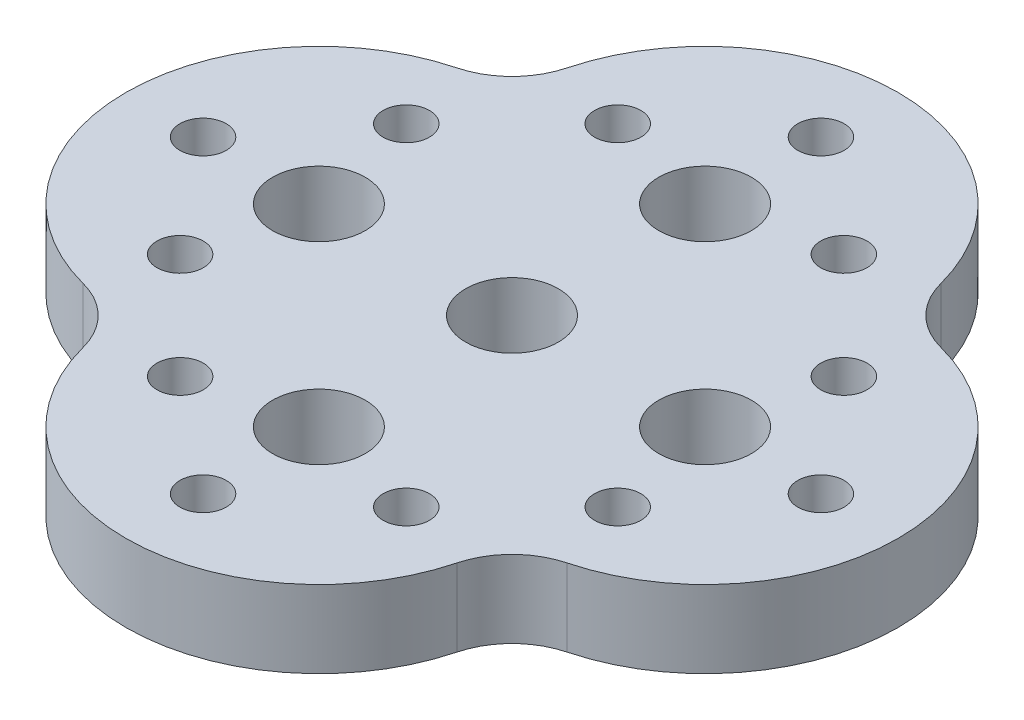
ISO-10303-21;
HEADER;
FILE_DESCRIPTION(('STEP AP214'),'2;1');
FILE_NAME('part.step','',(''),(''),'','','');
FILE_SCHEMA(('AUTOMOTIVE_DESIGN { 1 0 10303 214 1 1 1 1 }'));
ENDSEC;
DATA;
#1=APPLICATION_CONTEXT('core data for automotive mechanical design processes');
#2=APPLICATION_PROTOCOL_DEFINITION('international standard','automotive_design',2000,#1);
#3=PRODUCT_CONTEXT('',#1,'mechanical');
#4=PRODUCT('Part','Part','',(#3));
#5=PRODUCT_RELATED_PRODUCT_CATEGORY('part','',(#4));
#6=PRODUCT_DEFINITION_FORMATION('','',#4);
#7=PRODUCT_DEFINITION_CONTEXT('part definition',#1,'design');
#8=PRODUCT_DEFINITION('design','',#6,#7);
#9=PRODUCT_DEFINITION_SHAPE('','',#8);
#10=(LENGTH_UNIT() NAMED_UNIT(*) SI_UNIT(.MILLI.,.METRE.));
#11=(NAMED_UNIT(*) PLANE_ANGLE_UNIT() SI_UNIT($,.RADIAN.));
#12=(NAMED_UNIT(*) SI_UNIT($,.STERADIAN.) SOLID_ANGLE_UNIT());
#13=UNCERTAINTY_MEASURE_WITH_UNIT(LENGTH_MEASURE(1.E-05),#10,'distance_accuracy_value','');
#14=(GEOMETRIC_REPRESENTATION_CONTEXT(3) GLOBAL_UNCERTAINTY_ASSIGNED_CONTEXT((#13)) GLOBAL_UNIT_ASSIGNED_CONTEXT((#10,
#11,#12)) REPRESENTATION_CONTEXT('',''));
#15=CARTESIAN_POINT('',(0.,0.,0.));
#16=DIRECTION('',(0.,0.,1.));
#17=DIRECTION('',(1.,0.,0.));
#18=AXIS2_PLACEMENT_3D('',#15,#16,#17);
#19=CARTESIAN_POINT('',(860.044237827663,254.,860.044237827663));
#20=DIRECTION('',(0.,-1.,0.));
#21=DIRECTION('',(0.,0.,-1.));
#22=AXIS2_PLACEMENT_3D('',#19,#20,#21);
#23=CYLINDRICAL_SURFACE('',#22,254.);
#24=CARTESIAN_POINT('',(860.044237827663,0.,860.044237827663));
#25=DIRECTION('',(0.,-1.,0.));
#26=DIRECTION('',(0.,0.,-1.));
#27=AXIS2_PLACEMENT_3D('',#24,#25,#26);
#28=CIRCLE('',#27,254.);
#29=CARTESIAN_POINT('',(614.317312734045,0.,795.745884162617));
#30=VERTEX_POINT('',#29);
#31=CARTESIAN_POINT('',(795.745884162616,0.,614.317312734045));
#32=VERTEX_POINT('',#31);
#33=EDGE_CURVE('E199',#30,#32,#28,.T.);
#34=ORIENTED_EDGE('',*,*,#33,.T.);
#35=DIRECTION('',(0.,-1.,0.));
#36=VECTOR('',#35,1.);
#37=CARTESIAN_POINT('',(795.745884162616,254.,614.317312734045));
#38=LINE('',#37,#36);
#39=CARTESIAN_POINT('',(795.745884162616,254.,614.317312734045));
#40=VERTEX_POINT('',#39);
#41=EDGE_CURVE('E13',#40,#32,#38,.T.);
#42=ORIENTED_EDGE('',*,*,#41,.F.);
#43=CARTESIAN_POINT('',(860.044237827663,254.,860.044237827663));
#44=DIRECTION('',(0.,-1.,0.));
#45=DIRECTION('',(0.,0.,-1.));
#46=AXIS2_PLACEMENT_3D('',#43,#44,#45);
#47=CIRCLE('',#46,254.);
#48=CARTESIAN_POINT('',(614.317312734045,254.,795.745884162617));
#49=VERTEX_POINT('',#48);
#50=EDGE_CURVE('E214',#49,#40,#47,.T.);
#51=ORIENTED_EDGE('',*,*,#50,.F.);
#52=DIRECTION('',(0.,-1.,0.));
#53=VECTOR('',#52,1.);
#54=CARTESIAN_POINT('',(614.317312734045,254.,795.745884162617));
#55=LINE('',#54,#53);
#56=EDGE_CURVE('E195',#49,#30,#55,.T.);
#57=ORIENTED_EDGE('',*,*,#56,.T.);
#58=EDGE_LOOP('',(#34,#42,#51,#57));
#59=FACE_BOUND('',#58,.T.);
#60=ADVANCED_FACE('F103',(#59),#23,.F.);
#61=CARTESIAN_POINT('',(635.,254.,0.));
#62=DIRECTION('',(0.,-1.,0.));
#63=DIRECTION('',(0.,0.,-1.));
#64=AXIS2_PLACEMENT_3D('',#61,#62,#63);
#65=CYLINDRICAL_SURFACE('',#64,635.);
#66=CARTESIAN_POINT('',(635.,0.,0.));
#67=DIRECTION('',(0.,1.,0.));
#68=DIRECTION('',(0.,0.,-1.));
#69=AXIS2_PLACEMENT_3D('',#66,#67,#68);
#70=CIRCLE('',#69,635.);
#71=CARTESIAN_POINT('',(795.745884162616,0.,-614.317312734045));
#72=VERTEX_POINT('',#71);
#73=EDGE_CURVE('E202',#32,#72,#70,.T.);
#74=ORIENTED_EDGE('',*,*,#73,.T.);
#75=DIRECTION('',(0.,-1.,0.));
#76=VECTOR('',#75,1.);
#77=CARTESIAN_POINT('',(795.745884162616,254.,-614.317312734045));
#78=LINE('',#77,#76);
#79=CARTESIAN_POINT('',(795.745884162616,254.,-614.317312734045));
#80=VERTEX_POINT('',#79);
#81=EDGE_CURVE('E111',#80,#72,#78,.T.);
#82=ORIENTED_EDGE('',*,*,#81,.F.);
#83=CARTESIAN_POINT('',(635.,254.,0.));
#84=DIRECTION('',(0.,1.,0.));
#85=DIRECTION('',(0.,0.,-1.));
#86=AXIS2_PLACEMENT_3D('',#83,#84,#85);
#87=CIRCLE('',#86,635.);
#88=EDGE_CURVE('E162',#40,#80,#87,.T.);
#89=ORIENTED_EDGE('',*,*,#88,.F.);
#90=ORIENTED_EDGE('',*,*,#41,.T.);
#91=EDGE_LOOP('',(#74,#82,#89,#90));
#92=FACE_BOUND('',#91,.T.);
#93=ADVANCED_FACE('F409',(#92),#65,.T.);
#94=CARTESIAN_POINT('',(860.044237827663,254.,-860.044237827663));
#95=DIRECTION('',(0.,-1.,0.));
#96=DIRECTION('',(0.,0.,-1.));
#97=AXIS2_PLACEMENT_3D('',#94,#95,#96);
#98=CYLINDRICAL_SURFACE('',#97,254.);
#99=CARTESIAN_POINT('',(860.044237827663,0.,-860.044237827663));
#100=DIRECTION('',(0.,-1.,0.));
#101=DIRECTION('',(0.,0.,-1.));
#102=AXIS2_PLACEMENT_3D('',#99,#100,#101);
#103=CIRCLE('',#102,254.);
#104=CARTESIAN_POINT('',(614.317312734045,0.,-795.745884162616));
#105=VERTEX_POINT('',#104);
#106=EDGE_CURVE('E205',#72,#105,#103,.T.);
#107=ORIENTED_EDGE('',*,*,#106,.T.);
#108=DIRECTION('',(0.,-1.,0.));
#109=VECTOR('',#108,1.);
#110=CARTESIAN_POINT('',(614.317312734045,254.,-795.745884162616));
#111=LINE('',#110,#109);
#112=CARTESIAN_POINT('',(614.317312734045,254.,-795.745884162616));
#113=VERTEX_POINT('',#112);
#114=EDGE_CURVE('E221',#113,#105,#111,.T.);
#115=ORIENTED_EDGE('',*,*,#114,.F.);
#116=CARTESIAN_POINT('',(860.044237827663,254.,-860.044237827663));
#117=DIRECTION('',(0.,-1.,0.));
#118=DIRECTION('',(0.,0.,-1.));
#119=AXIS2_PLACEMENT_3D('',#116,#117,#118);
#120=CIRCLE('',#119,254.);
#121=EDGE_CURVE('E229',#80,#113,#120,.T.);
#122=ORIENTED_EDGE('',*,*,#121,.F.);
#123=ORIENTED_EDGE('',*,*,#81,.T.);
#124=EDGE_LOOP('',(#107,#115,#122,#123));
#125=FACE_BOUND('',#124,.T.);
#126=ADVANCED_FACE('F227',(#125),#98,.F.);
#127=CARTESIAN_POINT('',(0.,254.,-635.));
#128=DIRECTION('',(0.,-1.,0.));
#129=DIRECTION('',(0.,0.,-1.));
#130=AXIS2_PLACEMENT_3D('',#127,#128,#129);
#131=CYLINDRICAL_SURFACE('',#130,635.);
#132=CARTESIAN_POINT('',(0.,0.,-635.));
#133=DIRECTION('',(0.,1.,0.));
#134=DIRECTION('',(0.,0.,-1.));
#135=AXIS2_PLACEMENT_3D('',#132,#133,#134);
#136=CIRCLE('',#135,635.);
#137=CARTESIAN_POINT('',(-614.317312734045,0.,-795.745884162616));
#138=VERTEX_POINT('',#137);
#139=EDGE_CURVE('E207',#105,#138,#136,.T.);
#140=ORIENTED_EDGE('',*,*,#139,.T.);
#141=DIRECTION('',(0.,-1.,0.));
#142=VECTOR('',#141,1.);
#143=CARTESIAN_POINT('',(-614.317312734045,254.,-795.745884162616));
#144=LINE('',#143,#142);
#145=CARTESIAN_POINT('',(-614.317312734045,254.,-795.745884162616));
#146=VERTEX_POINT('',#145);
#147=EDGE_CURVE('E218',#146,#138,#144,.T.);
#148=ORIENTED_EDGE('',*,*,#147,.F.);
#149=CARTESIAN_POINT('',(0.,254.,-635.));
#150=DIRECTION('',(0.,1.,0.));
#151=DIRECTION('',(0.,0.,-1.));
#152=AXIS2_PLACEMENT_3D('',#149,#150,#151);
#153=CIRCLE('',#152,635.);
#154=EDGE_CURVE('E241',#113,#146,#153,.T.);
#155=ORIENTED_EDGE('',*,*,#154,.F.);
#156=ORIENTED_EDGE('',*,*,#114,.T.);
#157=EDGE_LOOP('',(#140,#148,#155,#156));
#158=FACE_BOUND('',#157,.T.);
#159=ADVANCED_FACE('F237',(#158),#131,.T.);
#160=CARTESIAN_POINT('',(-860.044237827663,254.,-860.044237827663));
#161=DIRECTION('',(0.,-1.,0.));
#162=DIRECTION('',(0.,0.,-1.));
#163=AXIS2_PLACEMENT_3D('',#160,#161,#162);
#164=CYLINDRICAL_SURFACE('',#163,254.);
#165=CARTESIAN_POINT('',(-860.044237827663,0.,-860.044237827663));
#166=DIRECTION('',(0.,-1.,0.));
#167=DIRECTION('',(0.,0.,-1.));
#168=AXIS2_PLACEMENT_3D('',#165,#166,#167);
#169=CIRCLE('',#168,254.);
#170=CARTESIAN_POINT('',(-795.745884162616,0.,-614.317312734045));
#171=VERTEX_POINT('',#170);
#172=EDGE_CURVE('E209',#138,#171,#169,.T.);
#173=ORIENTED_EDGE('',*,*,#172,.T.);
#174=DIRECTION('',(0.,-1.,0.));
#175=VECTOR('',#174,1.);
#176=CARTESIAN_POINT('',(-795.745884162616,254.,-614.317312734045));
#177=LINE('',#176,#175);
#178=CARTESIAN_POINT('',(-795.745884162616,254.,-614.317312734045));
#179=VERTEX_POINT('',#178);
#180=EDGE_CURVE('E190',#179,#171,#177,.T.);
#181=ORIENTED_EDGE('',*,*,#180,.F.);
#182=CARTESIAN_POINT('',(-860.044237827663,254.,-860.044237827663));
#183=DIRECTION('',(0.,-1.,0.));
#184=DIRECTION('',(0.,0.,-1.));
#185=AXIS2_PLACEMENT_3D('',#182,#183,#184);
#186=CIRCLE('',#185,254.);
#187=EDGE_CURVE('E181',#146,#179,#186,.T.);
#188=ORIENTED_EDGE('',*,*,#187,.F.);
#189=ORIENTED_EDGE('',*,*,#147,.T.);
#190=EDGE_LOOP('',(#173,#181,#188,#189));
#191=FACE_BOUND('',#190,.T.);
#192=ADVANCED_FACE('F240',(#191),#164,.F.);
#193=CARTESIAN_POINT('',(-635.,254.,0.));
#194=DIRECTION('',(0.,-1.,0.));
#195=DIRECTION('',(0.,0.,-1.));
#196=AXIS2_PLACEMENT_3D('',#193,#194,#195);
#197=CYLINDRICAL_SURFACE('',#196,635.);
#198=CARTESIAN_POINT('',(-635.,0.,0.));
#199=DIRECTION('',(0.,1.,0.));
#200=DIRECTION('',(0.,0.,1.));
#201=AXIS2_PLACEMENT_3D('',#198,#199,#200);
#202=CIRCLE('',#201,635.);
#203=CARTESIAN_POINT('',(-795.745884162616,0.,614.317312734045));
#204=VERTEX_POINT('',#203);
#205=EDGE_CURVE('E189',#171,#204,#202,.T.);
#206=ORIENTED_EDGE('',*,*,#205,.T.);
#207=DIRECTION('',(0.,-1.,0.));
#208=VECTOR('',#207,1.);
#209=CARTESIAN_POINT('',(-795.745884162616,254.,614.317312734045));
#210=LINE('',#209,#208);
#211=CARTESIAN_POINT('',(-795.745884162616,254.,614.317312734045));
#212=VERTEX_POINT('',#211);
#213=EDGE_CURVE('E186',#212,#204,#210,.T.);
#214=ORIENTED_EDGE('',*,*,#213,.F.);
#215=CARTESIAN_POINT('',(-635.,254.,0.));
#216=DIRECTION('',(0.,1.,0.));
#217=DIRECTION('',(0.,0.,1.));
#218=AXIS2_PLACEMENT_3D('',#215,#216,#217);
#219=CIRCLE('',#218,635.);
#220=EDGE_CURVE('E175',#179,#212,#219,.T.);
#221=ORIENTED_EDGE('',*,*,#220,.F.);
#222=ORIENTED_EDGE('',*,*,#180,.T.);
#223=EDGE_LOOP('',(#206,#214,#221,#222));
#224=FACE_BOUND('',#223,.T.);
#225=ADVANCED_FACE('F187',(#224),#197,.T.);
#226=CARTESIAN_POINT('',(-860.044237827663,254.,860.044237827663));
#227=DIRECTION('',(0.,-1.,0.));
#228=DIRECTION('',(0.,0.,-1.));
#229=AXIS2_PLACEMENT_3D('',#226,#227,#228);
#230=CYLINDRICAL_SURFACE('',#229,254.);
#231=CARTESIAN_POINT('',(-860.044237827663,0.,860.044237827663));
#232=DIRECTION('',(0.,-1.,0.));
#233=DIRECTION('',(0.,0.,-1.));
#234=AXIS2_PLACEMENT_3D('',#231,#232,#233);
#235=CIRCLE('',#234,254.);
#236=CARTESIAN_POINT('',(-614.317312734045,0.,795.745884162617));
#237=VERTEX_POINT('',#236);
#238=EDGE_CURVE('E148',#204,#237,#235,.T.);
#239=ORIENTED_EDGE('',*,*,#238,.T.);
#240=DIRECTION('',(0.,-1.,0.));
#241=VECTOR('',#240,1.);
#242=CARTESIAN_POINT('',(-614.317312734045,254.,795.745884162617));
#243=LINE('',#242,#241);
#244=CARTESIAN_POINT('',(-614.317312734045,254.,795.745884162617));
#245=VERTEX_POINT('',#244);
#246=EDGE_CURVE('E191',#245,#237,#243,.T.);
#247=ORIENTED_EDGE('',*,*,#246,.F.);
#248=CARTESIAN_POINT('',(-860.044237827663,254.,860.044237827663));
#249=DIRECTION('',(0.,-1.,0.));
#250=DIRECTION('',(0.,0.,-1.));
#251=AXIS2_PLACEMENT_3D('',#248,#249,#250);
#252=CIRCLE('',#251,254.);
#253=EDGE_CURVE('E179',#212,#245,#252,.T.);
#254=ORIENTED_EDGE('',*,*,#253,.F.);
#255=ORIENTED_EDGE('',*,*,#213,.T.);
#256=EDGE_LOOP('',(#239,#247,#254,#255));
#257=FACE_BOUND('',#256,.T.);
#258=ADVANCED_FACE('F193',(#257),#230,.F.);
#259=CARTESIAN_POINT('',(0.,254.,635.));
#260=DIRECTION('',(0.,-1.,0.));
#261=DIRECTION('',(0.,0.,-1.));
#262=AXIS2_PLACEMENT_3D('',#259,#260,#261);
#263=CYLINDRICAL_SURFACE('',#262,635.);
#264=CARTESIAN_POINT('',(0.,0.,635.));
#265=DIRECTION('',(0.,1.,0.));
#266=DIRECTION('',(0.,0.,-1.));
#267=AXIS2_PLACEMENT_3D('',#264,#265,#266);
#268=CIRCLE('',#267,635.);
#269=EDGE_CURVE('E154',#237,#30,#268,.T.);
#270=ORIENTED_EDGE('',*,*,#269,.T.);
#271=ORIENTED_EDGE('',*,*,#56,.F.);
#272=CARTESIAN_POINT('',(0.,254.,635.));
#273=DIRECTION('',(0.,1.,0.));
#274=DIRECTION('',(0.,0.,-1.));
#275=AXIS2_PLACEMENT_3D('',#272,#273,#274);
#276=CIRCLE('',#275,635.);
#277=EDGE_CURVE('E119',#245,#49,#276,.T.);
#278=ORIENTED_EDGE('',*,*,#277,.F.);
#279=ORIENTED_EDGE('',*,*,#246,.T.);
#280=EDGE_LOOP('',(#270,#271,#278,#279));
#281=FACE_BOUND('',#280,.T.);
#282=ADVANCED_FACE('F360',(#281),#263,.T.);
#283=CARTESIAN_POINT('',(747.522118913832,254.,430.022118913832));
#284=DIRECTION('',(0.,-1.,0.));
#285=DIRECTION('',(0.,0.,-1.));
#286=AXIS2_PLACEMENT_3D('',#283,#284,#285);
#287=PLANE('',#286);
#288=CARTESIAN_POINT('',(0.,254.,0.));
#289=DIRECTION('',(0.,1.,0.));
#290=DIRECTION('',(0.,0.,1.));
#291=AXIS2_PLACEMENT_3D('',#288,#289,#290);
#292=CIRCLE('',#291,152.4);
#293=CARTESIAN_POINT('',(0.,254.,152.4));
#294=VERTEX_POINT('',#293);
#295=EDGE_CURVE('E343',#294,#294,#292,.T.);
#296=ORIENTED_EDGE('',*,*,#295,.F.);
#297=EDGE_LOOP('',(#296));
#298=FACE_BOUND('',#297,.T.);
#299=CARTESIAN_POINT('',(-635.,254.000000000034,-1.11022302462516E-13));
#300=DIRECTION('',(0.,1.,0.));
#301=DIRECTION('',(0.,0.,1.));
#302=AXIS2_PLACEMENT_3D('',#299,#300,#301);
#303=CIRCLE('',#302,152.4);
#304=CARTESIAN_POINT('',(-635.,254.000000000034,152.4));
#305=VERTEX_POINT('',#304);
#306=EDGE_CURVE('E338',#305,#305,#303,.T.);
#307=ORIENTED_EDGE('',*,*,#306,.F.);
#308=EDGE_LOOP('',(#307));
#309=FACE_BOUND('',#308,.T.);
#310=CARTESIAN_POINT('',(0.,254.000000000034,635.));
#311=DIRECTION('',(0.,1.,0.));
#312=DIRECTION('',(0.,0.,1.));
#313=AXIS2_PLACEMENT_3D('',#310,#311,#312);
#314=CIRCLE('',#313,152.4);
#315=CARTESIAN_POINT('',(0.,254.000000000034,787.4));
#316=VERTEX_POINT('',#315);
#317=EDGE_CURVE('E332',#316,#316,#314,.T.);
#318=ORIENTED_EDGE('',*,*,#317,.F.);
#319=EDGE_LOOP('',(#318));
#320=FACE_BOUND('',#319,.T.);
#321=CARTESIAN_POINT('',(635.,254.000000000034,0.));
#322=DIRECTION('',(0.,1.,0.));
#323=DIRECTION('',(0.,0.,1.));
#324=AXIS2_PLACEMENT_3D('',#321,#322,#323);
#325=CIRCLE('',#324,152.4);
#326=CARTESIAN_POINT('',(635.,254.000000000034,152.4));
#327=VERTEX_POINT('',#326);
#328=EDGE_CURVE('E325',#327,#327,#325,.T.);
#329=ORIENTED_EDGE('',*,*,#328,.F.);
#330=EDGE_LOOP('',(#329));
#331=FACE_BOUND('',#330,.T.);
#332=CARTESIAN_POINT('',(0.,254.,-635.));
#333=DIRECTION('',(0.,1.,0.));
#334=DIRECTION('',(0.,0.,1.));
#335=AXIS2_PLACEMENT_3D('',#332,#333,#334);
#336=CIRCLE('',#335,152.4);
#337=CARTESIAN_POINT('',(0.,254.,-482.6));
#338=VERTEX_POINT('',#337);
#339=EDGE_CURVE('E319',#338,#338,#336,.T.);
#340=ORIENTED_EDGE('',*,*,#339,.F.);
#341=EDGE_LOOP('',(#340));
#342=FACE_BOUND('',#341,.T.);
#343=CARTESIAN_POINT('',(371.854888006537,254.000000000003,-719.562357425863));
#344=DIRECTION('',(0.,1.,0.));
#345=DIRECTION('',(0.,0.,1.));
#346=AXIS2_PLACEMENT_3D('',#343,#344,#345);
#347=CIRCLE('',#346,76.2);
#348=CARTESIAN_POINT('',(371.854888006537,254.000000000003,-643.362357425863));
#349=VERTEX_POINT('',#348);
#350=EDGE_CURVE('E302',#349,#349,#347,.T.);
#351=ORIENTED_EDGE('',*,*,#350,.F.);
#352=EDGE_LOOP('',(#351));
#353=FACE_BOUND('',#352,.T.);
#354=CARTESIAN_POINT('',(4.44089209850063E-13,254.000000000003,-1016.));
#355=DIRECTION('',(0.,1.,0.));
#356=DIRECTION('',(0.,0.,1.));
#357=AXIS2_PLACEMENT_3D('',#354,#355,#356);
#358=CIRCLE('',#357,76.2);
#359=CARTESIAN_POINT('',(4.44089209850063E-13,254.000000000003,-939.8));
#360=VERTEX_POINT('',#359);
#361=EDGE_CURVE('E296',#360,#360,#358,.T.);
#362=ORIENTED_EDGE('',*,*,#361,.F.);
#363=EDGE_LOOP('',(#362));
#364=FACE_BOUND('',#363,.T.);
#365=CARTESIAN_POINT('',(-371.854888006536,254.000000000003,-719.562357425864));
#366=DIRECTION('',(0.,1.,0.));
#367=DIRECTION('',(0.,0.,1.));
#368=AXIS2_PLACEMENT_3D('',#365,#366,#367);
#369=CIRCLE('',#368,76.2);
#370=CARTESIAN_POINT('',(-371.854888006536,254.000000000003,-643.362357425864));
#371=VERTEX_POINT('',#370);
#372=EDGE_CURVE('E290',#371,#371,#369,.T.);
#373=ORIENTED_EDGE('',*,*,#372,.F.);
#374=EDGE_LOOP('',(#373));
#375=FACE_BOUND('',#374,.T.);
#376=CARTESIAN_POINT('',(-719.562357425862,254.000000000003,-371.854888006537));
#377=DIRECTION('',(0.,1.,0.));
#378=DIRECTION('',(0.,0.,1.));
#379=AXIS2_PLACEMENT_3D('',#376,#377,#378);
#380=CIRCLE('',#379,76.2);
#381=CARTESIAN_POINT('',(-719.562357425862,254.000000000003,-295.654888006537));
#382=VERTEX_POINT('',#381);
#383=EDGE_CURVE('E284',#382,#382,#380,.T.);
#384=ORIENTED_EDGE('',*,*,#383,.F.);
#385=EDGE_LOOP('',(#384));
#386=FACE_BOUND('',#385,.T.);
#387=CARTESIAN_POINT('',(-1016.,254.000000000003,-4.14942696148656E-13));
#388=DIRECTION('',(0.,1.,0.));
#389=DIRECTION('',(0.,0.,1.));
#390=AXIS2_PLACEMENT_3D('',#387,#388,#389);
#391=CIRCLE('',#390,76.2);
#392=CARTESIAN_POINT('',(-1016.,254.000000000003,76.1999999999995));
#393=VERTEX_POINT('',#392);
#394=EDGE_CURVE('E278',#393,#393,#391,.T.);
#395=ORIENTED_EDGE('',*,*,#394,.F.);
#396=EDGE_LOOP('',(#395));
#397=FACE_BOUND('',#396,.T.);
#398=CARTESIAN_POINT('',(-719.562357425863,254.000000000003,371.854888006536));
#399=DIRECTION('',(0.,1.,0.));
#400=DIRECTION('',(0.,0.,1.));
#401=AXIS2_PLACEMENT_3D('',#398,#399,#400);
#402=CIRCLE('',#401,76.2);
#403=CARTESIAN_POINT('',(-719.562357425863,254.000000000003,448.054888006536));
#404=VERTEX_POINT('',#403);
#405=EDGE_CURVE('E272',#404,#404,#402,.T.);
#406=ORIENTED_EDGE('',*,*,#405,.F.);
#407=EDGE_LOOP('',(#406));
#408=FACE_BOUND('',#407,.T.);
#409=CARTESIAN_POINT('',(-371.854888006537,254.000000000003,719.562357425863));
#410=DIRECTION('',(0.,1.,0.));
#411=DIRECTION('',(0.,0.,1.));
#412=AXIS2_PLACEMENT_3D('',#409,#410,#411);
#413=CIRCLE('',#412,76.2);
#414=CARTESIAN_POINT('',(-371.854888006537,254.000000000003,795.762357425863));
#415=VERTEX_POINT('',#414);
#416=EDGE_CURVE('E266',#415,#415,#413,.T.);
#417=ORIENTED_EDGE('',*,*,#416,.F.);
#418=EDGE_LOOP('',(#417));
#419=FACE_BOUND('',#418,.T.);
#420=CARTESIAN_POINT('',(0.,254.000000000003,1016.));
#421=DIRECTION('',(0.,1.,0.));
#422=DIRECTION('',(0.,0.,1.));
#423=AXIS2_PLACEMENT_3D('',#420,#421,#422);
#424=CIRCLE('',#423,76.2);
#425=CARTESIAN_POINT('',(0.,254.000000000003,1092.2));
#426=VERTEX_POINT('',#425);
#427=EDGE_CURVE('E259',#426,#426,#424,.T.);
#428=ORIENTED_EDGE('',*,*,#427,.F.);
#429=EDGE_LOOP('',(#428));
#430=FACE_BOUND('',#429,.T.);
#431=CARTESIAN_POINT('',(371.854888006536,254.000000000003,719.562357425864));
#432=DIRECTION('',(0.,1.,0.));
#433=DIRECTION('',(0.,0.,1.));
#434=AXIS2_PLACEMENT_3D('',#431,#432,#433);
#435=CIRCLE('',#434,76.2);
#436=CARTESIAN_POINT('',(371.854888006536,254.000000000003,795.762357425864));
#437=VERTEX_POINT('',#436);
#438=EDGE_CURVE('E314',#437,#437,#435,.T.);
#439=ORIENTED_EDGE('',*,*,#438,.F.);
#440=EDGE_LOOP('',(#439));
#441=FACE_BOUND('',#440,.T.);
#442=CARTESIAN_POINT('',(719.562357425862,254.000000000003,371.854888006537));
#443=DIRECTION('',(0.,1.,0.));
#444=DIRECTION('',(0.,0.,1.));
#445=AXIS2_PLACEMENT_3D('',#442,#443,#444);
#446=CIRCLE('',#445,76.2);
#447=CARTESIAN_POINT('',(719.562357425862,254.000000000003,448.054888006537));
#448=VERTEX_POINT('',#447);
#449=EDGE_CURVE('E307',#448,#448,#446,.T.);
#450=ORIENTED_EDGE('',*,*,#449,.F.);
#451=EDGE_LOOP('',(#450));
#452=FACE_BOUND('',#451,.T.);
#453=CARTESIAN_POINT('',(719.562357425863,254.000000000003,-371.854888006536));
#454=DIRECTION('',(0.,1.,0.));
#455=DIRECTION('',(0.,0.,1.));
#456=AXIS2_PLACEMENT_3D('',#453,#454,#455);
#457=CIRCLE('',#456,76.2);
#458=CARTESIAN_POINT('',(719.562357425863,254.000000000003,-295.654888006537));
#459=VERTEX_POINT('',#458);
#460=EDGE_CURVE('E253',#459,#459,#457,.T.);
#461=ORIENTED_EDGE('',*,*,#460,.F.);
#462=EDGE_LOOP('',(#461));
#463=FACE_BOUND('',#462,.T.);
#464=CARTESIAN_POINT('',(1016.,254.,3.38395977905748E-13));
#465=DIRECTION('',(0.,1.,0.));
#466=DIRECTION('',(0.,0.,1.));
#467=AXIS2_PLACEMENT_3D('',#464,#465,#466);
#468=CIRCLE('',#467,76.2);
#469=CARTESIAN_POINT('',(1016.,254.,76.2000000000003));
#470=VERTEX_POINT('',#469);
#471=EDGE_CURVE('E247',#470,#470,#468,.T.);
#472=ORIENTED_EDGE('',*,*,#471,.F.);
#473=EDGE_LOOP('',(#472));
#474=FACE_BOUND('',#473,.T.);
#475=ORIENTED_EDGE('',*,*,#50,.T.);
#476=ORIENTED_EDGE('',*,*,#88,.T.);
#477=ORIENTED_EDGE('',*,*,#121,.T.);
#478=ORIENTED_EDGE('',*,*,#154,.T.);
#479=ORIENTED_EDGE('',*,*,#187,.T.);
#480=ORIENTED_EDGE('',*,*,#220,.T.);
#481=ORIENTED_EDGE('',*,*,#253,.T.);
#482=ORIENTED_EDGE('',*,*,#277,.T.);
#483=EDGE_LOOP('',(#475,#476,#477,#478,#479,#480,#481,#482));
#484=FACE_BOUND('',#483,.T.);
#485=ADVANCED_FACE('F177',(#298,#309,#320,#331,#342,#353,#364,#375,#386,#397,#408,#419,#430,
#441,#452,#463,#474,#484),#287,.F.);
#486=CARTESIAN_POINT('',(747.522118913832,0.,430.022118913832));
#487=DIRECTION('',(0.,-1.,0.));
#488=DIRECTION('',(0.,0.,-1.));
#489=AXIS2_PLACEMENT_3D('',#486,#487,#488);
#490=PLANE('',#489);
#491=CARTESIAN_POINT('',(0.,0.,0.));
#492=DIRECTION('',(0.,1.,0.));
#493=DIRECTION('',(0.,0.,1.));
#494=AXIS2_PLACEMENT_3D('',#491,#492,#493);
#495=CIRCLE('',#494,152.4);
#496=CARTESIAN_POINT('',(0.,0.,152.4));
#497=VERTEX_POINT('',#496);
#498=EDGE_CURVE('E329',#497,#497,#495,.T.);
#499=ORIENTED_EDGE('',*,*,#498,.T.);
#500=EDGE_LOOP('',(#499));
#501=FACE_BOUND('',#500,.T.);
#502=CARTESIAN_POINT('',(-635.,3.3806291099836E-11,-1.11022302462516E-13));
#503=DIRECTION('',(0.,1.,0.));
#504=DIRECTION('',(0.,0.,1.));
#505=AXIS2_PLACEMENT_3D('',#502,#503,#504);
#506=CIRCLE('',#505,152.4);
#507=CARTESIAN_POINT('',(-635.,3.3806291099836E-11,152.4));
#508=VERTEX_POINT('',#507);
#509=EDGE_CURVE('E322',#508,#508,#506,.T.);
#510=ORIENTED_EDGE('',*,*,#509,.T.);
#511=EDGE_LOOP('',(#510));
#512=FACE_BOUND('',#511,.T.);
#513=CARTESIAN_POINT('',(0.,3.3806291099836E-11,635.));
#514=DIRECTION('',(0.,1.,0.));
#515=DIRECTION('',(0.,0.,1.));
#516=AXIS2_PLACEMENT_3D('',#513,#514,#515);
#517=CIRCLE('',#516,152.4);
#518=CARTESIAN_POINT('',(0.,3.3806291099836E-11,787.4));
#519=VERTEX_POINT('',#518);
#520=EDGE_CURVE('E335',#519,#519,#517,.T.);
#521=ORIENTED_EDGE('',*,*,#520,.T.);
#522=EDGE_LOOP('',(#521));
#523=FACE_BOUND('',#522,.T.);
#524=CARTESIAN_POINT('',(635.,3.3806291099836E-11,0.));
#525=DIRECTION('',(0.,1.,0.));
#526=DIRECTION('',(0.,0.,1.));
#527=AXIS2_PLACEMENT_3D('',#524,#525,#526);
#528=CIRCLE('',#527,152.4);
#529=CARTESIAN_POINT('',(635.,3.3806291099836E-11,152.4));
#530=VERTEX_POINT('',#529);
#531=EDGE_CURVE('E328',#530,#530,#528,.T.);
#532=ORIENTED_EDGE('',*,*,#531,.T.);
#533=EDGE_LOOP('',(#532));
#534=FACE_BOUND('',#533,.T.);
#535=CARTESIAN_POINT('',(0.,0.,-635.));
#536=DIRECTION('',(0.,1.,0.));
#537=DIRECTION('',(0.,0.,1.));
#538=AXIS2_PLACEMENT_3D('',#535,#536,#537);
#539=CIRCLE('',#538,152.4);
#540=CARTESIAN_POINT('',(0.,0.,-482.6));
#541=VERTEX_POINT('',#540);
#542=EDGE_CURVE('E311',#541,#541,#539,.T.);
#543=ORIENTED_EDGE('',*,*,#542,.T.);
#544=EDGE_LOOP('',(#543));
#545=FACE_BOUND('',#544,.T.);
#546=CARTESIAN_POINT('',(371.854888006537,2.4980018054066E-12,-719.562357425863));
#547=DIRECTION('',(0.,1.,0.));
#548=DIRECTION('',(0.,0.,1.));
#549=AXIS2_PLACEMENT_3D('',#546,#547,#548);
#550=CIRCLE('',#549,76.2);
#551=CARTESIAN_POINT('',(371.854888006537,2.4980018054066E-12,-643.362357425863));
#552=VERTEX_POINT('',#551);
#553=EDGE_CURVE('E256',#552,#552,#550,.T.);
#554=ORIENTED_EDGE('',*,*,#553,.T.);
#555=EDGE_LOOP('',(#554));
#556=FACE_BOUND('',#555,.T.);
#557=CARTESIAN_POINT('',(4.44089209850063E-13,2.4980018054066E-12,-1016.));
#558=DIRECTION('',(0.,1.,0.));
#559=DIRECTION('',(0.,0.,1.));
#560=AXIS2_PLACEMENT_3D('',#557,#558,#559);
#561=CIRCLE('',#560,76.2);
#562=CARTESIAN_POINT('',(4.44089209850063E-13,2.4980018054066E-12,-939.8));
#563=VERTEX_POINT('',#562);
#564=EDGE_CURVE('E299',#563,#563,#561,.T.);
#565=ORIENTED_EDGE('',*,*,#564,.T.);
#566=EDGE_LOOP('',(#565));
#567=FACE_BOUND('',#566,.T.);
#568=CARTESIAN_POINT('',(-371.854888006536,2.4980018054066E-12,-719.562357425864));
#569=DIRECTION('',(0.,1.,0.));
#570=DIRECTION('',(0.,0.,1.));
#571=AXIS2_PLACEMENT_3D('',#568,#569,#570);
#572=CIRCLE('',#571,76.2);
#573=CARTESIAN_POINT('',(-371.854888006536,2.4980018054066E-12,-643.362357425864));
#574=VERTEX_POINT('',#573);
#575=EDGE_CURVE('E293',#574,#574,#572,.T.);
#576=ORIENTED_EDGE('',*,*,#575,.T.);
#577=EDGE_LOOP('',(#576));
#578=FACE_BOUND('',#577,.T.);
#579=CARTESIAN_POINT('',(-719.562357425862,2.4980018054066E-12,-371.854888006537));
#580=DIRECTION('',(0.,1.,0.));
#581=DIRECTION('',(0.,0.,1.));
#582=AXIS2_PLACEMENT_3D('',#579,#580,#581);
#583=CIRCLE('',#582,76.2);
#584=CARTESIAN_POINT('',(-719.562357425862,2.4980018054066E-12,-295.654888006537));
#585=VERTEX_POINT('',#584);
#586=EDGE_CURVE('E287',#585,#585,#583,.T.);
#587=ORIENTED_EDGE('',*,*,#586,.T.);
#588=EDGE_LOOP('',(#587));
#589=FACE_BOUND('',#588,.T.);
#590=CARTESIAN_POINT('',(-1016.,2.4980018054066E-12,-4.14942696148656E-13));
#591=DIRECTION('',(0.,1.,0.));
#592=DIRECTION('',(0.,0.,1.));
#593=AXIS2_PLACEMENT_3D('',#590,#591,#592);
#594=CIRCLE('',#593,76.2);
#595=CARTESIAN_POINT('',(-1016.,2.4980018054066E-12,76.1999999999995));
#596=VERTEX_POINT('',#595);
#597=EDGE_CURVE('E281',#596,#596,#594,.T.);
#598=ORIENTED_EDGE('',*,*,#597,.T.);
#599=EDGE_LOOP('',(#598));
#600=FACE_BOUND('',#599,.T.);
#601=CARTESIAN_POINT('',(-719.562357425863,2.4980018054066E-12,371.854888006536));
#602=DIRECTION('',(0.,1.,0.));
#603=DIRECTION('',(0.,0.,1.));
#604=AXIS2_PLACEMENT_3D('',#601,#602,#603);
#605=CIRCLE('',#604,76.2);
#606=CARTESIAN_POINT('',(-719.562357425863,2.4980018054066E-12,448.054888006536));
#607=VERTEX_POINT('',#606);
#608=EDGE_CURVE('E275',#607,#607,#605,.T.);
#609=ORIENTED_EDGE('',*,*,#608,.T.);
#610=EDGE_LOOP('',(#609));
#611=FACE_BOUND('',#610,.T.);
#612=CARTESIAN_POINT('',(-371.854888006537,2.4980018054066E-12,719.562357425863));
#613=DIRECTION('',(0.,1.,0.));
#614=DIRECTION('',(0.,0.,1.));
#615=AXIS2_PLACEMENT_3D('',#612,#613,#614);
#616=CIRCLE('',#615,76.2);
#617=CARTESIAN_POINT('',(-371.854888006537,2.4980018054066E-12,795.762357425863));
#618=VERTEX_POINT('',#617);
#619=EDGE_CURVE('E269',#618,#618,#616,.T.);
#620=ORIENTED_EDGE('',*,*,#619,.T.);
#621=EDGE_LOOP('',(#620));
#622=FACE_BOUND('',#621,.T.);
#623=CARTESIAN_POINT('',(0.,2.4980018054066E-12,1016.));
#624=DIRECTION('',(0.,1.,0.));
#625=DIRECTION('',(0.,0.,1.));
#626=AXIS2_PLACEMENT_3D('',#623,#624,#625);
#627=CIRCLE('',#626,76.2);
#628=CARTESIAN_POINT('',(0.,2.4980018054066E-12,1092.2));
#629=VERTEX_POINT('',#628);
#630=EDGE_CURVE('E262',#629,#629,#627,.T.);
#631=ORIENTED_EDGE('',*,*,#630,.T.);
#632=EDGE_LOOP('',(#631));
#633=FACE_BOUND('',#632,.T.);
#634=CARTESIAN_POINT('',(371.854888006536,2.4980018054066E-12,719.562357425864));
#635=DIRECTION('',(0.,1.,0.));
#636=DIRECTION('',(0.,0.,1.));
#637=AXIS2_PLACEMENT_3D('',#634,#635,#636);
#638=CIRCLE('',#637,76.2);
#639=CARTESIAN_POINT('',(371.854888006536,2.4980018054066E-12,795.762357425864));
#640=VERTEX_POINT('',#639);
#641=EDGE_CURVE('E263',#640,#640,#638,.T.);
#642=ORIENTED_EDGE('',*,*,#641,.T.);
#643=EDGE_LOOP('',(#642));
#644=FACE_BOUND('',#643,.T.);
#645=CARTESIAN_POINT('',(719.562357425862,2.4980018054066E-12,371.854888006537));
#646=DIRECTION('',(0.,1.,0.));
#647=DIRECTION('',(0.,0.,1.));
#648=AXIS2_PLACEMENT_3D('',#645,#646,#647);
#649=CIRCLE('',#648,76.2);
#650=CARTESIAN_POINT('',(719.562357425862,2.4980018054066E-12,448.054888006537));
#651=VERTEX_POINT('',#650);
#652=EDGE_CURVE('E310',#651,#651,#649,.T.);
#653=ORIENTED_EDGE('',*,*,#652,.T.);
#654=EDGE_LOOP('',(#653));
#655=FACE_BOUND('',#654,.T.);
#656=CARTESIAN_POINT('',(719.562357425863,2.4980018054066E-12,-371.854888006536));
#657=DIRECTION('',(0.,1.,0.));
#658=DIRECTION('',(0.,0.,1.));
#659=AXIS2_PLACEMENT_3D('',#656,#657,#658);
#660=CIRCLE('',#659,76.2);
#661=CARTESIAN_POINT('',(719.562357425863,2.4980018054066E-12,-295.654888006537));
#662=VERTEX_POINT('',#661);
#663=EDGE_CURVE('E250',#662,#662,#660,.T.);
#664=ORIENTED_EDGE('',*,*,#663,.T.);
#665=EDGE_LOOP('',(#664));
#666=FACE_BOUND('',#665,.T.);
#667=CARTESIAN_POINT('',(1016.,0.,3.38395977905748E-13));
#668=DIRECTION('',(0.,1.,0.));
#669=DIRECTION('',(0.,0.,1.));
#670=AXIS2_PLACEMENT_3D('',#667,#668,#669);
#671=CIRCLE('',#670,76.2);
#672=CARTESIAN_POINT('',(1016.,0.,76.2000000000003));
#673=VERTEX_POINT('',#672);
#674=EDGE_CURVE('E203',#673,#673,#671,.T.);
#675=ORIENTED_EDGE('',*,*,#674,.T.);
#676=EDGE_LOOP('',(#675));
#677=FACE_BOUND('',#676,.T.);
#678=ORIENTED_EDGE('',*,*,#33,.F.);
#679=ORIENTED_EDGE('',*,*,#269,.F.);
#680=ORIENTED_EDGE('',*,*,#238,.F.);
#681=ORIENTED_EDGE('',*,*,#205,.F.);
#682=ORIENTED_EDGE('',*,*,#172,.F.);
#683=ORIENTED_EDGE('',*,*,#139,.F.);
#684=ORIENTED_EDGE('',*,*,#106,.F.);
#685=ORIENTED_EDGE('',*,*,#73,.F.);
#686=EDGE_LOOP('',(#678,#679,#680,#681,#682,#683,#684,#685));
#687=FACE_BOUND('',#686,.T.);
#688=ADVANCED_FACE('F233',(#501,#512,#523,#534,#545,#556,#567,#578,#589,#600,#611,#622,#633,
#644,#655,#666,#677,#687),#490,.T.);
#689=CARTESIAN_POINT('',(1016.,0.,3.38395977905748E-13));
#690=DIRECTION('',(0.,1.,0.));
#691=DIRECTION('',(0.,0.,1.));
#692=AXIS2_PLACEMENT_3D('',#689,#690,#691);
#693=CYLINDRICAL_SURFACE('',#692,76.2);
#694=ORIENTED_EDGE('',*,*,#674,.F.);
#695=EDGE_LOOP('',(#694));
#696=FACE_BOUND('',#695,.T.);
#697=ORIENTED_EDGE('',*,*,#471,.T.);
#698=EDGE_LOOP('',(#697));
#699=FACE_BOUND('',#698,.T.);
#700=ADVANCED_FACE('F394',(#696,#699),#693,.F.);
#701=CARTESIAN_POINT('',(719.562357425863,2.4980018054066E-12,-371.854888006536));
#702=DIRECTION('',(0.,1.,0.));
#703=DIRECTION('',(0.,0.,1.));
#704=AXIS2_PLACEMENT_3D('',#701,#702,#703);
#705=CYLINDRICAL_SURFACE('',#704,76.2);
#706=ORIENTED_EDGE('',*,*,#663,.F.);
#707=EDGE_LOOP('',(#706));
#708=FACE_BOUND('',#707,.T.);
#709=ORIENTED_EDGE('',*,*,#460,.T.);
#710=EDGE_LOOP('',(#709));
#711=FACE_BOUND('',#710,.T.);
#712=ADVANCED_FACE('F396',(#708,#711),#705,.F.);
#713=CARTESIAN_POINT('',(719.562357425862,2.4980018054066E-12,371.854888006537));
#714=DIRECTION('',(0.,1.,0.));
#715=DIRECTION('',(0.,0.,1.));
#716=AXIS2_PLACEMENT_3D('',#713,#714,#715);
#717=CYLINDRICAL_SURFACE('',#716,76.2);
#718=ORIENTED_EDGE('',*,*,#652,.F.);
#719=EDGE_LOOP('',(#718));
#720=FACE_BOUND('',#719,.T.);
#721=ORIENTED_EDGE('',*,*,#449,.T.);
#722=EDGE_LOOP('',(#721));
#723=FACE_BOUND('',#722,.T.);
#724=ADVANCED_FACE('F403',(#720,#723),#717,.F.);
#725=CARTESIAN_POINT('',(371.854888006536,2.4980018054066E-12,719.562357425864));
#726=DIRECTION('',(0.,1.,0.));
#727=DIRECTION('',(0.,0.,1.));
#728=AXIS2_PLACEMENT_3D('',#725,#726,#727);
#729=CYLINDRICAL_SURFACE('',#728,76.2);
#730=ORIENTED_EDGE('',*,*,#641,.F.);
#731=EDGE_LOOP('',(#730));
#732=FACE_BOUND('',#731,.T.);
#733=ORIENTED_EDGE('',*,*,#438,.T.);
#734=EDGE_LOOP('',(#733));
#735=FACE_BOUND('',#734,.T.);
#736=ADVANCED_FACE('F475',(#732,#735),#729,.F.);
#737=CARTESIAN_POINT('',(0.,2.4980018054066E-12,1016.));
#738=DIRECTION('',(0.,1.,0.));
#739=DIRECTION('',(0.,0.,1.));
#740=AXIS2_PLACEMENT_3D('',#737,#738,#739);
#741=CYLINDRICAL_SURFACE('',#740,76.2);
#742=ORIENTED_EDGE('',*,*,#630,.F.);
#743=EDGE_LOOP('',(#742));
#744=FACE_BOUND('',#743,.T.);
#745=ORIENTED_EDGE('',*,*,#427,.T.);
#746=EDGE_LOOP('',(#745));
#747=FACE_BOUND('',#746,.T.);
#748=ADVANCED_FACE('F485',(#744,#747),#741,.F.);
#749=CARTESIAN_POINT('',(-371.854888006537,2.4980018054066E-12,719.562357425863));
#750=DIRECTION('',(0.,1.,0.));
#751=DIRECTION('',(0.,0.,1.));
#752=AXIS2_PLACEMENT_3D('',#749,#750,#751);
#753=CYLINDRICAL_SURFACE('',#752,76.2);
#754=ORIENTED_EDGE('',*,*,#619,.F.);
#755=EDGE_LOOP('',(#754));
#756=FACE_BOUND('',#755,.T.);
#757=ORIENTED_EDGE('',*,*,#416,.T.);
#758=EDGE_LOOP('',(#757));
#759=FACE_BOUND('',#758,.T.);
#760=ADVANCED_FACE('F495',(#756,#759),#753,.F.);
#761=CARTESIAN_POINT('',(-719.562357425863,2.4980018054066E-12,371.854888006536));
#762=DIRECTION('',(0.,1.,0.));
#763=DIRECTION('',(0.,0.,1.));
#764=AXIS2_PLACEMENT_3D('',#761,#762,#763);
#765=CYLINDRICAL_SURFACE('',#764,76.2);
#766=ORIENTED_EDGE('',*,*,#608,.F.);
#767=EDGE_LOOP('',(#766));
#768=FACE_BOUND('',#767,.T.);
#769=ORIENTED_EDGE('',*,*,#405,.T.);
#770=EDGE_LOOP('',(#769));
#771=FACE_BOUND('',#770,.T.);
#772=ADVANCED_FACE('F505',(#768,#771),#765,.F.);
#773=CARTESIAN_POINT('',(-1016.,2.4980018054066E-12,-4.14942696148656E-13));
#774=DIRECTION('',(0.,1.,0.));
#775=DIRECTION('',(0.,0.,1.));
#776=AXIS2_PLACEMENT_3D('',#773,#774,#775);
#777=CYLINDRICAL_SURFACE('',#776,76.2);
#778=ORIENTED_EDGE('',*,*,#597,.F.);
#779=EDGE_LOOP('',(#778));
#780=FACE_BOUND('',#779,.T.);
#781=ORIENTED_EDGE('',*,*,#394,.T.);
#782=EDGE_LOOP('',(#781));
#783=FACE_BOUND('',#782,.T.);
#784=ADVANCED_FACE('F515',(#780,#783),#777,.F.);
#785=CARTESIAN_POINT('',(-719.562357425862,2.4980018054066E-12,-371.854888006537));
#786=DIRECTION('',(0.,1.,0.));
#787=DIRECTION('',(0.,0.,1.));
#788=AXIS2_PLACEMENT_3D('',#785,#786,#787);
#789=CYLINDRICAL_SURFACE('',#788,76.2);
#790=ORIENTED_EDGE('',*,*,#586,.F.);
#791=EDGE_LOOP('',(#790));
#792=FACE_BOUND('',#791,.T.);
#793=ORIENTED_EDGE('',*,*,#383,.T.);
#794=EDGE_LOOP('',(#793));
#795=FACE_BOUND('',#794,.T.);
#796=ADVANCED_FACE('F525',(#792,#795),#789,.F.);
#797=CARTESIAN_POINT('',(-371.854888006536,2.4980018054066E-12,-719.562357425864));
#798=DIRECTION('',(0.,1.,0.));
#799=DIRECTION('',(0.,0.,1.));
#800=AXIS2_PLACEMENT_3D('',#797,#798,#799);
#801=CYLINDRICAL_SURFACE('',#800,76.2);
#802=ORIENTED_EDGE('',*,*,#575,.F.);
#803=EDGE_LOOP('',(#802));
#804=FACE_BOUND('',#803,.T.);
#805=ORIENTED_EDGE('',*,*,#372,.T.);
#806=EDGE_LOOP('',(#805));
#807=FACE_BOUND('',#806,.T.);
#808=ADVANCED_FACE('F535',(#804,#807),#801,.F.);
#809=CARTESIAN_POINT('',(4.44089209850063E-13,2.4980018054066E-12,-1016.));
#810=DIRECTION('',(0.,1.,0.));
#811=DIRECTION('',(0.,0.,1.));
#812=AXIS2_PLACEMENT_3D('',#809,#810,#811);
#813=CYLINDRICAL_SURFACE('',#812,76.2);
#814=ORIENTED_EDGE('',*,*,#564,.F.);
#815=EDGE_LOOP('',(#814));
#816=FACE_BOUND('',#815,.T.);
#817=ORIENTED_EDGE('',*,*,#361,.T.);
#818=EDGE_LOOP('',(#817));
#819=FACE_BOUND('',#818,.T.);
#820=ADVANCED_FACE('F545',(#816,#819),#813,.F.);
#821=CARTESIAN_POINT('',(371.854888006537,2.4980018054066E-12,-719.562357425863));
#822=DIRECTION('',(0.,1.,0.));
#823=DIRECTION('',(0.,0.,1.));
#824=AXIS2_PLACEMENT_3D('',#821,#822,#823);
#825=CYLINDRICAL_SURFACE('',#824,76.2);
#826=ORIENTED_EDGE('',*,*,#553,.F.);
#827=EDGE_LOOP('',(#826));
#828=FACE_BOUND('',#827,.T.);
#829=ORIENTED_EDGE('',*,*,#350,.T.);
#830=EDGE_LOOP('',(#829));
#831=FACE_BOUND('',#830,.T.);
#832=ADVANCED_FACE('F555',(#828,#831),#825,.F.);
#833=CARTESIAN_POINT('',(0.,0.,-635.));
#834=DIRECTION('',(0.,1.,0.));
#835=DIRECTION('',(0.,0.,1.));
#836=AXIS2_PLACEMENT_3D('',#833,#834,#835);
#837=CYLINDRICAL_SURFACE('',#836,152.4);
#838=ORIENTED_EDGE('',*,*,#542,.F.);
#839=EDGE_LOOP('',(#838));
#840=FACE_BOUND('',#839,.T.);
#841=ORIENTED_EDGE('',*,*,#339,.T.);
#842=EDGE_LOOP('',(#841));
#843=FACE_BOUND('',#842,.T.);
#844=ADVANCED_FACE('F565',(#840,#843),#837,.F.);
#845=CARTESIAN_POINT('',(635.,3.3806291099836E-11,0.));
#846=DIRECTION('',(0.,1.,0.));
#847=DIRECTION('',(0.,0.,1.));
#848=AXIS2_PLACEMENT_3D('',#845,#846,#847);
#849=CYLINDRICAL_SURFACE('',#848,152.4);
#850=ORIENTED_EDGE('',*,*,#531,.F.);
#851=EDGE_LOOP('',(#850));
#852=FACE_BOUND('',#851,.T.);
#853=ORIENTED_EDGE('',*,*,#328,.T.);
#854=EDGE_LOOP('',(#853));
#855=FACE_BOUND('',#854,.T.);
#856=ADVANCED_FACE('F575',(#852,#855),#849,.F.);
#857=CARTESIAN_POINT('',(0.,3.3806291099836E-11,635.));
#858=DIRECTION('',(0.,1.,0.));
#859=DIRECTION('',(0.,0.,1.));
#860=AXIS2_PLACEMENT_3D('',#857,#858,#859);
#861=CYLINDRICAL_SURFACE('',#860,152.4);
#862=ORIENTED_EDGE('',*,*,#520,.F.);
#863=EDGE_LOOP('',(#862));
#864=FACE_BOUND('',#863,.T.);
#865=ORIENTED_EDGE('',*,*,#317,.T.);
#866=EDGE_LOOP('',(#865));
#867=FACE_BOUND('',#866,.T.);
#868=ADVANCED_FACE('F585',(#864,#867),#861,.F.);
#869=CARTESIAN_POINT('',(-635.,3.3806291099836E-11,-1.11022302462516E-13));
#870=DIRECTION('',(0.,1.,0.));
#871=DIRECTION('',(0.,0.,1.));
#872=AXIS2_PLACEMENT_3D('',#869,#870,#871);
#873=CYLINDRICAL_SURFACE('',#872,152.4);
#874=ORIENTED_EDGE('',*,*,#509,.F.);
#875=EDGE_LOOP('',(#874));
#876=FACE_BOUND('',#875,.T.);
#877=ORIENTED_EDGE('',*,*,#306,.T.);
#878=EDGE_LOOP('',(#877));
#879=FACE_BOUND('',#878,.T.);
#880=ADVANCED_FACE('F354',(#876,#879),#873,.F.);
#881=CARTESIAN_POINT('',(0.,0.,0.));
#882=DIRECTION('',(0.,1.,0.));
#883=DIRECTION('',(0.,0.,1.));
#884=AXIS2_PLACEMENT_3D('',#881,#882,#883);
#885=CYLINDRICAL_SURFACE('',#884,152.4);
#886=ORIENTED_EDGE('',*,*,#498,.F.);
#887=EDGE_LOOP('',(#886));
#888=FACE_BOUND('',#887,.T.);
#889=ORIENTED_EDGE('',*,*,#295,.T.);
#890=EDGE_LOOP('',(#889));
#891=FACE_BOUND('',#890,.T.);
#892=ADVANCED_FACE('F351',(#888,#891),#885,.F.);
#893=CLOSED_SHELL('',(#60,#93,#126,#159,#192,#225,#258,#282,#485,#688,#700,#712,#724,#736,#748,
#760,#772,#784,#796,#808,#820,#832,#844,#856,#868,#880,#892));
#894=MANIFOLD_SOLID_BREP('B2',#893);
#895=ADVANCED_BREP_SHAPE_REPRESENTATION('',(#18,#894),#14);
#896=SHAPE_DEFINITION_REPRESENTATION(#9,#895);
ENDSEC;
END-ISO-10303-21;
